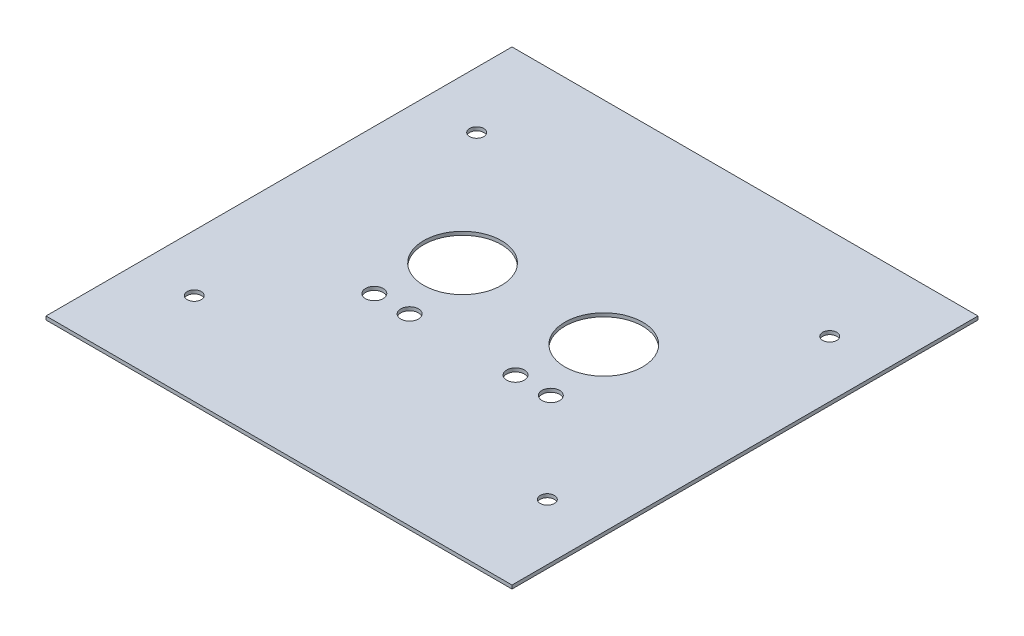
ISO-10303-21;
HEADER;
FILE_DESCRIPTION(('STEP AP214'),'2;1');
FILE_NAME('part.step','',(''),(''),'','','');
FILE_SCHEMA(('AUTOMOTIVE_DESIGN { 1 0 10303 214 1 1 1 1 }'));
ENDSEC;
DATA;
#1=APPLICATION_CONTEXT('core data for automotive mechanical design processes');
#2=APPLICATION_PROTOCOL_DEFINITION('international standard','automotive_design',2000,#1);
#3=PRODUCT_CONTEXT('',#1,'mechanical');
#4=PRODUCT('Part','Part','',(#3));
#5=PRODUCT_RELATED_PRODUCT_CATEGORY('part','',(#4));
#6=PRODUCT_DEFINITION_FORMATION('','',#4);
#7=PRODUCT_DEFINITION_CONTEXT('part definition',#1,'design');
#8=PRODUCT_DEFINITION('design','',#6,#7);
#9=PRODUCT_DEFINITION_SHAPE('','',#8);
#10=(LENGTH_UNIT() NAMED_UNIT(*) SI_UNIT(.MILLI.,.METRE.));
#11=(NAMED_UNIT(*) PLANE_ANGLE_UNIT() SI_UNIT($,.RADIAN.));
#12=(NAMED_UNIT(*) SI_UNIT($,.STERADIAN.) SOLID_ANGLE_UNIT());
#13=UNCERTAINTY_MEASURE_WITH_UNIT(LENGTH_MEASURE(1.E-05),#10,'distance_accuracy_value','');
#14=(GEOMETRIC_REPRESENTATION_CONTEXT(3) GLOBAL_UNCERTAINTY_ASSIGNED_CONTEXT((#13)) GLOBAL_UNIT_ASSIGNED_CONTEXT((#10,
#11,#12)) REPRESENTATION_CONTEXT('',''));
#15=CARTESIAN_POINT('',(0.,0.,0.));
#16=DIRECTION('',(0.,0.,1.));
#17=DIRECTION('',(1.,0.,0.));
#18=AXIS2_PLACEMENT_3D('',#15,#16,#17);
#19=CARTESIAN_POINT('',(-26.6885438978218,1.,22.2049050632911));
#20=DIRECTION('',(0.,1.,0.));
#21=DIRECTION('',(0.,0.,1.));
#22=AXIS2_PLACEMENT_3D('',#19,#20,#21);
#23=PLANE('',#22);
#24=CARTESIAN_POINT('',(-10.6885438978218,1.,-83.7950949367088));
#25=DIRECTION('',(0.,-1.,0.));
#26=DIRECTION('',(0.,0.,-1.));
#27=AXIS2_PLACEMENT_3D('',#24,#25,#26);
#28=CIRCLE('',#27,2.);
#29=CARTESIAN_POINT('',(-10.6885438978218,1.,-85.7950949367088));
#30=VERTEX_POINT('',#29);
#31=EDGE_CURVE('E163',#30,#30,#28,.T.);
#32=ORIENTED_EDGE('',*,*,#31,.T.);
#33=EDGE_LOOP('',(#32));
#34=FACE_BOUND('',#33,.T.);
#35=CARTESIAN_POINT('',(89.3114561021783,1.,-83.7950949367088));
#36=DIRECTION('',(0.,-1.,0.));
#37=DIRECTION('',(0.,0.,-1.));
#38=AXIS2_PLACEMENT_3D('',#35,#36,#37);
#39=CIRCLE('',#38,2.);
#40=CARTESIAN_POINT('',(89.3114561021783,1.,-85.7950949367088));
#41=VERTEX_POINT('',#40);
#42=EDGE_CURVE('E157',#41,#41,#39,.T.);
#43=ORIENTED_EDGE('',*,*,#42,.T.);
#44=EDGE_LOOP('',(#43));
#45=FACE_BOUND('',#44,.T.);
#46=CARTESIAN_POINT('',(89.3114561021783,1.,-3.79509493670883));
#47=DIRECTION('',(0.,-1.,0.));
#48=DIRECTION('',(0.,0.,-1.));
#49=AXIS2_PLACEMENT_3D('',#46,#47,#48);
#50=CIRCLE('',#49,2.);
#51=CARTESIAN_POINT('',(89.3114561021783,1.,-5.79509493670883));
#52=VERTEX_POINT('',#51);
#53=EDGE_CURVE('E151',#52,#52,#50,.T.);
#54=ORIENTED_EDGE('',*,*,#53,.T.);
#55=EDGE_LOOP('',(#54));
#56=FACE_BOUND('',#55,.T.);
#57=CARTESIAN_POINT('',(-10.6885438978217,1.,-3.79509493670886));
#58=DIRECTION('',(0.,-1.,0.));
#59=DIRECTION('',(0.,0.,-1.));
#60=AXIS2_PLACEMENT_3D('',#57,#58,#59);
#61=CIRCLE('',#60,2.);
#62=CARTESIAN_POINT('',(-10.6885438978217,1.,-5.79509493670886));
#63=VERTEX_POINT('',#62);
#64=EDGE_CURVE('E145',#63,#63,#61,.T.);
#65=ORIENTED_EDGE('',*,*,#64,.T.);
#66=EDGE_LOOP('',(#65));
#67=FACE_BOUND('',#66,.T.);
#68=CARTESIAN_POINT('',(19.3114561021782,1.,-49.7950949367089));
#69=DIRECTION('',(0.,1.,0.));
#70=DIRECTION('',(0.,0.,1.));
#71=AXIS2_PLACEMENT_3D('',#68,#69,#70);
#72=CIRCLE('',#71,11.);
#73=CARTESIAN_POINT('',(19.3114561021782,1.,-38.7950949367089));
#74=VERTEX_POINT('',#73);
#75=EDGE_CURVE('E133',#74,#74,#72,.T.);
#76=ORIENTED_EDGE('',*,*,#75,.F.);
#77=EDGE_LOOP('',(#76));
#78=FACE_BOUND('',#77,.T.);
#79=CARTESIAN_POINT('',(54.3114561021782,1.,-29.7950949367089));
#80=DIRECTION('',(0.,1.,0.));
#81=DIRECTION('',(0.,0.,1.));
#82=AXIS2_PLACEMENT_3D('',#79,#80,#81);
#83=CIRCLE('',#82,2.49999999999999);
#84=CARTESIAN_POINT('',(54.3114561021782,1.,-27.2950949367089));
#85=VERTEX_POINT('',#84);
#86=EDGE_CURVE('E121',#85,#85,#83,.T.);
#87=ORIENTED_EDGE('',*,*,#86,.F.);
#88=EDGE_LOOP('',(#87));
#89=FACE_BOUND('',#88,.T.);
#90=CARTESIAN_POINT('',(14.3114561021782,1.,-29.7950949367089));
#91=DIRECTION('',(0.,1.,0.));
#92=DIRECTION('',(0.,0.,1.));
#93=AXIS2_PLACEMENT_3D('',#90,#91,#92);
#94=CIRCLE('',#93,2.49999999999999);
#95=CARTESIAN_POINT('',(14.3114561021782,1.,-27.2950949367089));
#96=VERTEX_POINT('',#95);
#97=EDGE_CURVE('E100',#96,#96,#94,.T.);
#98=ORIENTED_EDGE('',*,*,#97,.F.);
#99=EDGE_LOOP('',(#98));
#100=FACE_BOUND('',#99,.T.);
#101=DIRECTION('',(0.,0.,1.));
#102=VECTOR('',#101,1.);
#103=CARTESIAN_POINT('',(-26.6885438978218,1.,-109.795094936709));
#104=LINE('',#103,#102);
#105=CARTESIAN_POINT('',(-26.6885438978218,1.,-109.795094936709));
#106=VERTEX_POINT('',#105);
#107=CARTESIAN_POINT('',(-26.6885438978218,1.,22.2049050632911));
#108=VERTEX_POINT('',#107);
#109=EDGE_CURVE('E85',#106,#108,#104,.T.);
#110=ORIENTED_EDGE('',*,*,#109,.T.);
#111=DIRECTION('',(1.,0.,0.));
#112=VECTOR('',#111,1.);
#113=CARTESIAN_POINT('',(-26.6885438978218,1.,22.2049050632911));
#114=LINE('',#113,#112);
#115=CARTESIAN_POINT('',(105.311456102178,1.,22.2049050632911));
#116=VERTEX_POINT('',#115);
#117=EDGE_CURVE('E80',#108,#116,#114,.T.);
#118=ORIENTED_EDGE('',*,*,#117,.T.);
#119=DIRECTION('',(0.,0.,-1.));
#120=VECTOR('',#119,1.);
#121=CARTESIAN_POINT('',(105.311456102178,1.,-109.795094936709));
#122=LINE('',#121,#120);
#123=CARTESIAN_POINT('',(105.311456102178,1.,-109.795094936709));
#124=VERTEX_POINT('',#123);
#125=EDGE_CURVE('E83',#116,#124,#122,.T.);
#126=ORIENTED_EDGE('',*,*,#125,.T.);
#127=DIRECTION('',(-1.,0.,0.));
#128=VECTOR('',#127,1.);
#129=CARTESIAN_POINT('',(-26.6885438978218,1.,-109.795094936709));
#130=LINE('',#129,#128);
#131=EDGE_CURVE('E50',#124,#106,#130,.T.);
#132=ORIENTED_EDGE('',*,*,#131,.T.);
#133=EDGE_LOOP('',(#110,#118,#126,#132));
#134=FACE_BOUND('',#133,.T.);
#135=CARTESIAN_POINT('',(24.3114561021782,1.,-29.7950949367089));
#136=DIRECTION('',(0.,1.,0.));
#137=DIRECTION('',(0.,0.,1.));
#138=AXIS2_PLACEMENT_3D('',#135,#136,#137);
#139=CIRCLE('',#138,2.49999999999999);
#140=CARTESIAN_POINT('',(24.3114561021782,1.,-27.2950949367089));
#141=VERTEX_POINT('',#140);
#142=EDGE_CURVE('E115',#141,#141,#139,.T.);
#143=ORIENTED_EDGE('',*,*,#142,.F.);
#144=EDGE_LOOP('',(#143));
#145=FACE_BOUND('',#144,.T.);
#146=CARTESIAN_POINT('',(64.3114561021782,1.,-29.7950949367089));
#147=DIRECTION('',(0.,1.,0.));
#148=DIRECTION('',(0.,0.,1.));
#149=AXIS2_PLACEMENT_3D('',#146,#147,#148);
#150=CIRCLE('',#149,2.49999999999999);
#151=CARTESIAN_POINT('',(64.3114561021782,1.,-27.2950949367089));
#152=VERTEX_POINT('',#151);
#153=EDGE_CURVE('E127',#152,#152,#150,.T.);
#154=ORIENTED_EDGE('',*,*,#153,.F.);
#155=EDGE_LOOP('',(#154));
#156=FACE_BOUND('',#155,.T.);
#157=CARTESIAN_POINT('',(59.3114561021782,1.,-49.7950949367089));
#158=DIRECTION('',(0.,1.,0.));
#159=DIRECTION('',(0.,0.,1.));
#160=AXIS2_PLACEMENT_3D('',#157,#158,#159);
#161=CIRCLE('',#160,11.);
#162=CARTESIAN_POINT('',(59.3114561021782,1.,-38.7950949367089));
#163=VERTEX_POINT('',#162);
#164=EDGE_CURVE('E139',#163,#163,#161,.T.);
#165=ORIENTED_EDGE('',*,*,#164,.F.);
#166=EDGE_LOOP('',(#165));
#167=FACE_BOUND('',#166,.T.);
#168=ADVANCED_FACE('F33',(#34,#45,#56,#67,#78,#89,#100,#134,#145,#156,#167),#23,.T.);
#169=CARTESIAN_POINT('',(-26.6885438978218,0.,22.2049050632911));
#170=DIRECTION('',(0.,1.,0.));
#171=DIRECTION('',(0.,0.,1.));
#172=AXIS2_PLACEMENT_3D('',#169,#170,#171);
#173=PLANE('',#172);
#174=CARTESIAN_POINT('',(-10.6885438978218,0.,-83.7950949367088));
#175=DIRECTION('',(0.,-1.,0.));
#176=DIRECTION('',(0.,0.,-1.));
#177=AXIS2_PLACEMENT_3D('',#174,#175,#176);
#178=CIRCLE('',#177,2.);
#179=CARTESIAN_POINT('',(-10.6885438978218,0.,-85.7950949367088));
#180=VERTEX_POINT('',#179);
#181=EDGE_CURVE('E166',#180,#180,#178,.T.);
#182=ORIENTED_EDGE('',*,*,#181,.F.);
#183=EDGE_LOOP('',(#182));
#184=FACE_BOUND('',#183,.T.);
#185=CARTESIAN_POINT('',(89.3114561021783,0.,-83.7950949367088));
#186=DIRECTION('',(0.,-1.,0.));
#187=DIRECTION('',(0.,0.,-1.));
#188=AXIS2_PLACEMENT_3D('',#185,#186,#187);
#189=CIRCLE('',#188,2.);
#190=CARTESIAN_POINT('',(89.3114561021783,0.,-85.7950949367088));
#191=VERTEX_POINT('',#190);
#192=EDGE_CURVE('E160',#191,#191,#189,.T.);
#193=ORIENTED_EDGE('',*,*,#192,.F.);
#194=EDGE_LOOP('',(#193));
#195=FACE_BOUND('',#194,.T.);
#196=CARTESIAN_POINT('',(89.3114561021783,0.,-3.79509493670883));
#197=DIRECTION('',(0.,-1.,0.));
#198=DIRECTION('',(0.,0.,-1.));
#199=AXIS2_PLACEMENT_3D('',#196,#197,#198);
#200=CIRCLE('',#199,2.);
#201=CARTESIAN_POINT('',(89.3114561021783,0.,-5.79509493670883));
#202=VERTEX_POINT('',#201);
#203=EDGE_CURVE('E154',#202,#202,#200,.T.);
#204=ORIENTED_EDGE('',*,*,#203,.F.);
#205=EDGE_LOOP('',(#204));
#206=FACE_BOUND('',#205,.T.);
#207=CARTESIAN_POINT('',(-10.6885438978217,0.,-3.79509493670886));
#208=DIRECTION('',(0.,-1.,0.));
#209=DIRECTION('',(0.,0.,-1.));
#210=AXIS2_PLACEMENT_3D('',#207,#208,#209);
#211=CIRCLE('',#210,2.);
#212=CARTESIAN_POINT('',(-10.6885438978217,0.,-5.79509493670886));
#213=VERTEX_POINT('',#212);
#214=EDGE_CURVE('E148',#213,#213,#211,.T.);
#215=ORIENTED_EDGE('',*,*,#214,.F.);
#216=EDGE_LOOP('',(#215));
#217=FACE_BOUND('',#216,.T.);
#218=CARTESIAN_POINT('',(19.3114561021782,0.,-49.7950949367089));
#219=DIRECTION('',(0.,1.,0.));
#220=DIRECTION('',(0.,0.,1.));
#221=AXIS2_PLACEMENT_3D('',#218,#219,#220);
#222=CIRCLE('',#221,11.);
#223=CARTESIAN_POINT('',(19.3114561021782,0.,-38.7950949367089));
#224=VERTEX_POINT('',#223);
#225=EDGE_CURVE('E136',#224,#224,#222,.T.);
#226=ORIENTED_EDGE('',*,*,#225,.T.);
#227=EDGE_LOOP('',(#226));
#228=FACE_BOUND('',#227,.T.);
#229=CARTESIAN_POINT('',(54.3114561021782,0.,-29.7950949367089));
#230=DIRECTION('',(0.,1.,0.));
#231=DIRECTION('',(0.,0.,1.));
#232=AXIS2_PLACEMENT_3D('',#229,#230,#231);
#233=CIRCLE('',#232,2.49999999999999);
#234=CARTESIAN_POINT('',(54.3114561021782,0.,-27.2950949367089));
#235=VERTEX_POINT('',#234);
#236=EDGE_CURVE('E124',#235,#235,#233,.T.);
#237=ORIENTED_EDGE('',*,*,#236,.T.);
#238=EDGE_LOOP('',(#237));
#239=FACE_BOUND('',#238,.T.);
#240=CARTESIAN_POINT('',(14.3114561021782,0.,-29.7950949367089));
#241=DIRECTION('',(0.,1.,0.));
#242=DIRECTION('',(0.,0.,1.));
#243=AXIS2_PLACEMENT_3D('',#240,#241,#242);
#244=CIRCLE('',#243,2.49999999999999);
#245=CARTESIAN_POINT('',(14.3114561021782,0.,-27.2950949367089));
#246=VERTEX_POINT('',#245);
#247=EDGE_CURVE('E112',#246,#246,#244,.T.);
#248=ORIENTED_EDGE('',*,*,#247,.T.);
#249=EDGE_LOOP('',(#248));
#250=FACE_BOUND('',#249,.T.);
#251=DIRECTION('',(0.,0.,1.));
#252=VECTOR('',#251,1.);
#253=CARTESIAN_POINT('',(-26.6885438978218,0.,-109.795094936709));
#254=LINE('',#253,#252);
#255=CARTESIAN_POINT('',(-26.6885438978218,0.,-109.795094936709));
#256=VERTEX_POINT('',#255);
#257=CARTESIAN_POINT('',(-26.6885438978218,0.,22.2049050632911));
#258=VERTEX_POINT('',#257);
#259=EDGE_CURVE('E97',#256,#258,#254,.T.);
#260=ORIENTED_EDGE('',*,*,#259,.F.);
#261=DIRECTION('',(-1.,0.,0.));
#262=VECTOR('',#261,1.);
#263=CARTESIAN_POINT('',(-26.6885438978218,0.,-109.795094936709));
#264=LINE('',#263,#262);
#265=CARTESIAN_POINT('',(105.311456102178,0.,-109.795094936709));
#266=VERTEX_POINT('',#265);
#267=EDGE_CURVE('E73',#266,#256,#264,.T.);
#268=ORIENTED_EDGE('',*,*,#267,.F.);
#269=DIRECTION('',(0.,0.,-1.));
#270=VECTOR('',#269,1.);
#271=CARTESIAN_POINT('',(105.311456102178,0.,-109.795094936709));
#272=LINE('',#271,#270);
#273=CARTESIAN_POINT('',(105.311456102178,0.,22.2049050632911));
#274=VERTEX_POINT('',#273);
#275=EDGE_CURVE('E67',#274,#266,#272,.T.);
#276=ORIENTED_EDGE('',*,*,#275,.F.);
#277=DIRECTION('',(1.,0.,0.));
#278=VECTOR('',#277,1.);
#279=CARTESIAN_POINT('',(-26.6885438978218,0.,22.2049050632911));
#280=LINE('',#279,#278);
#281=EDGE_CURVE('E89',#258,#274,#280,.T.);
#282=ORIENTED_EDGE('',*,*,#281,.F.);
#283=EDGE_LOOP('',(#260,#268,#276,#282));
#284=FACE_BOUND('',#283,.T.);
#285=CARTESIAN_POINT('',(24.3114561021782,0.,-29.7950949367089));
#286=DIRECTION('',(0.,1.,0.));
#287=DIRECTION('',(0.,0.,1.));
#288=AXIS2_PLACEMENT_3D('',#285,#286,#287);
#289=CIRCLE('',#288,2.49999999999999);
#290=CARTESIAN_POINT('',(24.3114561021782,0.,-27.2950949367089));
#291=VERTEX_POINT('',#290);
#292=EDGE_CURVE('E118',#291,#291,#289,.T.);
#293=ORIENTED_EDGE('',*,*,#292,.T.);
#294=EDGE_LOOP('',(#293));
#295=FACE_BOUND('',#294,.T.);
#296=CARTESIAN_POINT('',(64.3114561021782,0.,-29.7950949367089));
#297=DIRECTION('',(0.,1.,0.));
#298=DIRECTION('',(0.,0.,1.));
#299=AXIS2_PLACEMENT_3D('',#296,#297,#298);
#300=CIRCLE('',#299,2.49999999999999);
#301=CARTESIAN_POINT('',(64.3114561021782,0.,-27.2950949367089));
#302=VERTEX_POINT('',#301);
#303=EDGE_CURVE('E130',#302,#302,#300,.T.);
#304=ORIENTED_EDGE('',*,*,#303,.T.);
#305=EDGE_LOOP('',(#304));
#306=FACE_BOUND('',#305,.T.);
#307=CARTESIAN_POINT('',(59.3114561021782,0.,-49.7950949367089));
#308=DIRECTION('',(0.,1.,0.));
#309=DIRECTION('',(0.,0.,1.));
#310=AXIS2_PLACEMENT_3D('',#307,#308,#309);
#311=CIRCLE('',#310,11.);
#312=CARTESIAN_POINT('',(59.3114561021782,0.,-38.7950949367089));
#313=VERTEX_POINT('',#312);
#314=EDGE_CURVE('E142',#313,#313,#311,.T.);
#315=ORIENTED_EDGE('',*,*,#314,.T.);
#316=EDGE_LOOP('',(#315));
#317=FACE_BOUND('',#316,.T.);
#318=ADVANCED_FACE('F108',(#184,#195,#206,#217,#228,#239,#250,#284,#295,#306,#317),#173,.F.);
#319=CARTESIAN_POINT('',(-26.6885438978218,1.,-109.795094936709));
#320=DIRECTION('',(1.,0.,0.));
#321=DIRECTION('',(0.,0.,-1.));
#322=AXIS2_PLACEMENT_3D('',#319,#320,#321);
#323=PLANE('',#322);
#324=ORIENTED_EDGE('',*,*,#259,.T.);
#325=DIRECTION('',(0.,-1.,0.));
#326=VECTOR('',#325,1.);
#327=CARTESIAN_POINT('',(-26.6885438978218,1.,22.2049050632911));
#328=LINE('',#327,#326);
#329=EDGE_CURVE('E11',#108,#258,#328,.T.);
#330=ORIENTED_EDGE('',*,*,#329,.F.);
#331=ORIENTED_EDGE('',*,*,#109,.F.);
#332=DIRECTION('',(0.,-1.,0.));
#333=VECTOR('',#332,1.);
#334=CARTESIAN_POINT('',(-26.6885438978218,1.,-109.795094936709));
#335=LINE('',#334,#333);
#336=EDGE_CURVE('E93',#106,#256,#335,.T.);
#337=ORIENTED_EDGE('',*,*,#336,.T.);
#338=EDGE_LOOP('',(#324,#330,#331,#337));
#339=FACE_BOUND('',#338,.T.);
#340=ADVANCED_FACE('F35',(#339),#323,.F.);
#341=CARTESIAN_POINT('',(-26.6885438978218,1.,22.2049050632911));
#342=DIRECTION('',(0.,0.,-1.));
#343=DIRECTION('',(-1.,0.,0.));
#344=AXIS2_PLACEMENT_3D('',#341,#342,#343);
#345=PLANE('',#344);
#346=ORIENTED_EDGE('',*,*,#281,.T.);
#347=DIRECTION('',(0.,-1.,0.));
#348=VECTOR('',#347,1.);
#349=CARTESIAN_POINT('',(105.311456102178,1.,22.2049050632911));
#350=LINE('',#349,#348);
#351=EDGE_CURVE('E42',#116,#274,#350,.T.);
#352=ORIENTED_EDGE('',*,*,#351,.F.);
#353=ORIENTED_EDGE('',*,*,#117,.F.);
#354=ORIENTED_EDGE('',*,*,#329,.T.);
#355=EDGE_LOOP('',(#346,#352,#353,#354));
#356=FACE_BOUND('',#355,.T.);
#357=ADVANCED_FACE('F88',(#356),#345,.F.);
#358=CARTESIAN_POINT('',(105.311456102178,1.,-109.795094936709));
#359=DIRECTION('',(-1.,0.,0.));
#360=DIRECTION('',(0.,0.,1.));
#361=AXIS2_PLACEMENT_3D('',#358,#359,#360);
#362=PLANE('',#361);
#363=ORIENTED_EDGE('',*,*,#275,.T.);
#364=DIRECTION('',(0.,-1.,0.));
#365=VECTOR('',#364,1.);
#366=CARTESIAN_POINT('',(105.311456102178,1.,-109.795094936709));
#367=LINE('',#366,#365);
#368=EDGE_CURVE('E90',#124,#266,#367,.T.);
#369=ORIENTED_EDGE('',*,*,#368,.F.);
#370=ORIENTED_EDGE('',*,*,#125,.F.);
#371=ORIENTED_EDGE('',*,*,#351,.T.);
#372=EDGE_LOOP('',(#363,#369,#370,#371));
#373=FACE_BOUND('',#372,.T.);
#374=ADVANCED_FACE('F91',(#373),#362,.F.);
#375=CARTESIAN_POINT('',(-26.6885438978218,1.,-109.795094936709));
#376=DIRECTION('',(0.,0.,1.));
#377=DIRECTION('',(1.,0.,0.));
#378=AXIS2_PLACEMENT_3D('',#375,#376,#377);
#379=PLANE('',#378);
#380=ORIENTED_EDGE('',*,*,#267,.T.);
#381=ORIENTED_EDGE('',*,*,#336,.F.);
#382=ORIENTED_EDGE('',*,*,#131,.F.);
#383=ORIENTED_EDGE('',*,*,#368,.T.);
#384=EDGE_LOOP('',(#380,#381,#382,#383));
#385=FACE_BOUND('',#384,.T.);
#386=ADVANCED_FACE('F105',(#385),#379,.F.);
#387=CARTESIAN_POINT('',(14.3114561021782,1.,-29.7950949367089));
#388=DIRECTION('',(0.,-1.,0.));
#389=DIRECTION('',(0.,0.,-1.));
#390=AXIS2_PLACEMENT_3D('',#387,#388,#389);
#391=CYLINDRICAL_SURFACE('',#390,2.49999999999999);
#392=ORIENTED_EDGE('',*,*,#97,.T.);
#393=EDGE_LOOP('',(#392));
#394=FACE_BOUND('',#393,.T.);
#395=ORIENTED_EDGE('',*,*,#247,.F.);
#396=EDGE_LOOP('',(#395));
#397=FACE_BOUND('',#396,.T.);
#398=ADVANCED_FACE('F196',(#394,#397),#391,.F.);
#399=CARTESIAN_POINT('',(24.3114561021782,1.,-29.7950949367089));
#400=DIRECTION('',(0.,-1.,0.));
#401=DIRECTION('',(0.,0.,-1.));
#402=AXIS2_PLACEMENT_3D('',#399,#400,#401);
#403=CYLINDRICAL_SURFACE('',#402,2.49999999999999);
#404=ORIENTED_EDGE('',*,*,#142,.T.);
#405=EDGE_LOOP('',(#404));
#406=FACE_BOUND('',#405,.T.);
#407=ORIENTED_EDGE('',*,*,#292,.F.);
#408=EDGE_LOOP('',(#407));
#409=FACE_BOUND('',#408,.T.);
#410=ADVANCED_FACE('F198',(#406,#409),#403,.F.);
#411=CARTESIAN_POINT('',(54.3114561021782,1.,-29.7950949367089));
#412=DIRECTION('',(0.,-1.,0.));
#413=DIRECTION('',(0.,0.,-1.));
#414=AXIS2_PLACEMENT_3D('',#411,#412,#413);
#415=CYLINDRICAL_SURFACE('',#414,2.49999999999999);
#416=ORIENTED_EDGE('',*,*,#86,.T.);
#417=EDGE_LOOP('',(#416));
#418=FACE_BOUND('',#417,.T.);
#419=ORIENTED_EDGE('',*,*,#236,.F.);
#420=EDGE_LOOP('',(#419));
#421=FACE_BOUND('',#420,.T.);
#422=ADVANCED_FACE('F205',(#418,#421),#415,.F.);
#423=CARTESIAN_POINT('',(64.3114561021782,1.,-29.7950949367089));
#424=DIRECTION('',(0.,-1.,0.));
#425=DIRECTION('',(0.,0.,-1.));
#426=AXIS2_PLACEMENT_3D('',#423,#424,#425);
#427=CYLINDRICAL_SURFACE('',#426,2.49999999999999);
#428=ORIENTED_EDGE('',*,*,#153,.T.);
#429=EDGE_LOOP('',(#428));
#430=FACE_BOUND('',#429,.T.);
#431=ORIENTED_EDGE('',*,*,#303,.F.);
#432=EDGE_LOOP('',(#431));
#433=FACE_BOUND('',#432,.T.);
#434=ADVANCED_FACE('F278',(#430,#433),#427,.F.);
#435=CARTESIAN_POINT('',(19.3114561021782,1.,-49.7950949367089));
#436=DIRECTION('',(0.,-1.,0.));
#437=DIRECTION('',(0.,0.,-1.));
#438=AXIS2_PLACEMENT_3D('',#435,#436,#437);
#439=CYLINDRICAL_SURFACE('',#438,11.);
#440=ORIENTED_EDGE('',*,*,#75,.T.);
#441=EDGE_LOOP('',(#440));
#442=FACE_BOUND('',#441,.T.);
#443=ORIENTED_EDGE('',*,*,#225,.F.);
#444=EDGE_LOOP('',(#443));
#445=FACE_BOUND('',#444,.T.);
#446=ADVANCED_FACE('F274',(#442,#445),#439,.F.);
#447=CARTESIAN_POINT('',(59.3114561021782,1.,-49.7950949367089));
#448=DIRECTION('',(0.,-1.,0.));
#449=DIRECTION('',(0.,0.,-1.));
#450=AXIS2_PLACEMENT_3D('',#447,#448,#449);
#451=CYLINDRICAL_SURFACE('',#450,11.);
#452=ORIENTED_EDGE('',*,*,#164,.T.);
#453=EDGE_LOOP('',(#452));
#454=FACE_BOUND('',#453,.T.);
#455=ORIENTED_EDGE('',*,*,#314,.F.);
#456=EDGE_LOOP('',(#455));
#457=FACE_BOUND('',#456,.T.);
#458=ADVANCED_FACE('F239',(#454,#457),#451,.F.);
#459=CARTESIAN_POINT('',(-10.6885438978217,1.,-3.79509493670886));
#460=DIRECTION('',(0.,-1.,0.));
#461=DIRECTION('',(0.,0.,-1.));
#462=AXIS2_PLACEMENT_3D('',#459,#460,#461);
#463=CYLINDRICAL_SURFACE('',#462,2.);
#464=ORIENTED_EDGE('',*,*,#64,.F.);
#465=EDGE_LOOP('',(#464));
#466=FACE_BOUND('',#465,.T.);
#467=ORIENTED_EDGE('',*,*,#214,.T.);
#468=EDGE_LOOP('',(#467));
#469=FACE_BOUND('',#468,.T.);
#470=ADVANCED_FACE('F233',(#466,#469),#463,.F.);
#471=CARTESIAN_POINT('',(89.3114561021783,1.,-3.79509493670883));
#472=DIRECTION('',(0.,-1.,0.));
#473=DIRECTION('',(0.,0.,-1.));
#474=AXIS2_PLACEMENT_3D('',#471,#472,#473);
#475=CYLINDRICAL_SURFACE('',#474,2.);
#476=ORIENTED_EDGE('',*,*,#53,.F.);
#477=EDGE_LOOP('',(#476));
#478=FACE_BOUND('',#477,.T.);
#479=ORIENTED_EDGE('',*,*,#203,.T.);
#480=EDGE_LOOP('',(#479));
#481=FACE_BOUND('',#480,.T.);
#482=ADVANCED_FACE('F238',(#478,#481),#475,.F.);
#483=CARTESIAN_POINT('',(89.3114561021783,1.,-83.7950949367088));
#484=DIRECTION('',(0.,-1.,0.));
#485=DIRECTION('',(0.,0.,-1.));
#486=AXIS2_PLACEMENT_3D('',#483,#484,#485);
#487=CYLINDRICAL_SURFACE('',#486,2.);
#488=ORIENTED_EDGE('',*,*,#42,.F.);
#489=EDGE_LOOP('',(#488));
#490=FACE_BOUND('',#489,.T.);
#491=ORIENTED_EDGE('',*,*,#192,.T.);
#492=EDGE_LOOP('',(#491));
#493=FACE_BOUND('',#492,.T.);
#494=ADVANCED_FACE('F177',(#490,#493),#487,.F.);
#495=CARTESIAN_POINT('',(-10.6885438978218,1.,-83.7950949367088));
#496=DIRECTION('',(0.,-1.,0.));
#497=DIRECTION('',(0.,0.,-1.));
#498=AXIS2_PLACEMENT_3D('',#495,#496,#497);
#499=CYLINDRICAL_SURFACE('',#498,2.);
#500=ORIENTED_EDGE('',*,*,#31,.F.);
#501=EDGE_LOOP('',(#500));
#502=FACE_BOUND('',#501,.T.);
#503=ORIENTED_EDGE('',*,*,#181,.T.);
#504=EDGE_LOOP('',(#503));
#505=FACE_BOUND('',#504,.T.);
#506=ADVANCED_FACE('F174',(#502,#505),#499,.F.);
#507=CLOSED_SHELL('',(#168,#318,#340,#357,#374,#386,#398,#410,#422,#434,#446,#458,#470,#482,
#494,#506));
#508=MANIFOLD_SOLID_BREP('B2',#507);
#509=ADVANCED_BREP_SHAPE_REPRESENTATION('',(#18,#508),#14);
#510=SHAPE_DEFINITION_REPRESENTATION(#9,#509);
ENDSEC;
END-ISO-10303-21;
